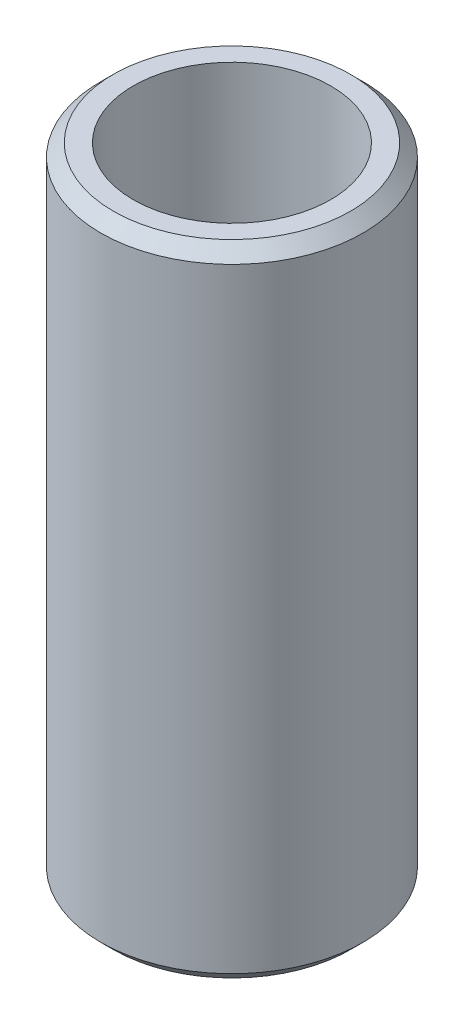
ISO-10303-21;
HEADER;
FILE_DESCRIPTION(('STEP AP214'),'2;1');
FILE_NAME('part.step','',(''),(''),'','','');
FILE_SCHEMA(('AUTOMOTIVE_DESIGN { 1 0 10303 214 1 1 1 1 }'));
ENDSEC;
DATA;
#1=APPLICATION_CONTEXT('core data for automotive mechanical design processes');
#2=APPLICATION_PROTOCOL_DEFINITION('international standard','automotive_design',2000,#1);
#3=PRODUCT_CONTEXT('',#1,'mechanical');
#4=PRODUCT('Part','Part','',(#3));
#5=PRODUCT_RELATED_PRODUCT_CATEGORY('part','',(#4));
#6=PRODUCT_DEFINITION_FORMATION('','',#4);
#7=PRODUCT_DEFINITION_CONTEXT('part definition',#1,'design');
#8=PRODUCT_DEFINITION('design','',#6,#7);
#9=PRODUCT_DEFINITION_SHAPE('','',#8);
#10=(LENGTH_UNIT() NAMED_UNIT(*) SI_UNIT(.MILLI.,.METRE.));
#11=(NAMED_UNIT(*) PLANE_ANGLE_UNIT() SI_UNIT($,.RADIAN.));
#12=(NAMED_UNIT(*) SI_UNIT($,.STERADIAN.) SOLID_ANGLE_UNIT());
#13=UNCERTAINTY_MEASURE_WITH_UNIT(LENGTH_MEASURE(1.E-05),#10,'distance_accuracy_value','');
#14=(GEOMETRIC_REPRESENTATION_CONTEXT(3) GLOBAL_UNCERTAINTY_ASSIGNED_CONTEXT((#13)) GLOBAL_UNIT_ASSIGNED_CONTEXT((#10,
#11,#12)) REPRESENTATION_CONTEXT('',''));
#15=CARTESIAN_POINT('',(0.,0.,0.));
#16=DIRECTION('',(0.,0.,1.));
#17=DIRECTION('',(1.,0.,0.));
#18=AXIS2_PLACEMENT_3D('',#15,#16,#17);
#19=CARTESIAN_POINT('',(0.,280.298555757313,0.));
#20=DIRECTION('',(0.,-1.,0.));
#21=DIRECTION('',(0.,0.,-1.));
#22=AXIS2_PLACEMENT_3D('',#19,#20,#21);
#23=CYLINDRICAL_SURFACE('',#22,57.5);
#24=CARTESIAN_POINT('',(0.,274.777303484476,0.));
#25=DIRECTION('',(0.,1.,0.));
#26=DIRECTION('',(0.,0.,1.));
#27=AXIS2_PLACEMENT_3D('',#24,#25,#26);
#28=CIRCLE('',#27,57.5);
#29=CARTESIAN_POINT('',(0.,274.777303484476,57.5));
#30=VERTEX_POINT('',#29);
#31=EDGE_CURVE('E50',#30,#30,#28,.F.);
#32=ORIENTED_EDGE('',*,*,#31,.T.);
#33=EDGE_LOOP('',(#32));
#34=FACE_BOUND('',#33,.T.);
#35=CARTESIAN_POINT('',(0.,5.52125227283723,0.));
#36=DIRECTION('',(0.,1.,0.));
#37=DIRECTION('',(0.,0.,1.));
#38=AXIS2_PLACEMENT_3D('',#35,#36,#37);
#39=CIRCLE('',#38,57.5);
#40=CARTESIAN_POINT('',(0.,5.52125227283723,57.5));
#41=VERTEX_POINT('',#40);
#42=EDGE_CURVE('E51',#41,#41,#39,.T.);
#43=ORIENTED_EDGE('',*,*,#42,.T.);
#44=EDGE_LOOP('',(#43));
#45=FACE_BOUND('',#44,.T.);
#46=ADVANCED_FACE('F39',(#34,#45),#23,.T.);
#47=CARTESIAN_POINT('',(0.,280.298555757313,0.));
#48=DIRECTION('',(0.,1.,0.));
#49=DIRECTION('',(0.,0.,1.));
#50=AXIS2_PLACEMENT_3D('',#47,#48,#49);
#51=PLANE('',#50);
#52=CARTESIAN_POINT('',(0.,280.298555757313,0.));
#53=DIRECTION('',(0.,1.,0.));
#54=DIRECTION('',(0.,0.,1.));
#55=AXIS2_PLACEMENT_3D('',#52,#53,#54);
#56=CIRCLE('',#55,51.9787477271627);
#57=CARTESIAN_POINT('',(0.,280.298555757313,51.9787477271627));
#58=VERTEX_POINT('',#57);
#59=EDGE_CURVE('E54',#58,#58,#56,.T.);
#60=ORIENTED_EDGE('',*,*,#59,.T.);
#61=EDGE_LOOP('',(#60));
#62=FACE_BOUND('',#61,.T.);
#63=CARTESIAN_POINT('',(0.,280.298555757313,0.));
#64=DIRECTION('',(0.,1.,0.));
#65=DIRECTION('',(0.,0.,1.));
#66=AXIS2_PLACEMENT_3D('',#63,#64,#65);
#67=CIRCLE('',#66,43.2547459969688);
#68=CARTESIAN_POINT('',(0.,280.298555757313,43.2547459969688));
#69=VERTEX_POINT('',#68);
#70=EDGE_CURVE('E58',#69,#69,#67,.T.);
#71=ORIENTED_EDGE('',*,*,#70,.F.);
#72=EDGE_LOOP('',(#71));
#73=FACE_BOUND('',#72,.T.);
#74=ADVANCED_FACE('F69',(#62,#73),#51,.T.);
#75=CARTESIAN_POINT('',(0.,0.,0.));
#76=DIRECTION('',(0.,1.,0.));
#77=DIRECTION('',(0.,0.,1.));
#78=AXIS2_PLACEMENT_3D('',#75,#76,#77);
#79=PLANE('',#78);
#80=CARTESIAN_POINT('',(0.,0.,0.));
#81=DIRECTION('',(0.,1.,0.));
#82=DIRECTION('',(0.,0.,1.));
#83=AXIS2_PLACEMENT_3D('',#80,#81,#82);
#84=CIRCLE('',#83,51.9787477271627);
#85=CARTESIAN_POINT('',(0.,0.,51.9787477271627));
#86=VERTEX_POINT('',#85);
#87=EDGE_CURVE('E10',#86,#86,#84,.F.);
#88=ORIENTED_EDGE('',*,*,#87,.T.);
#89=EDGE_LOOP('',(#88));
#90=FACE_BOUND('',#89,.T.);
#91=CARTESIAN_POINT('',(0.,0.,0.));
#92=DIRECTION('',(0.,1.,0.));
#93=DIRECTION('',(0.,0.,1.));
#94=AXIS2_PLACEMENT_3D('',#91,#92,#93);
#95=CIRCLE('',#94,43.2547459969688);
#96=CARTESIAN_POINT('',(0.,0.,43.2547459969688));
#97=VERTEX_POINT('',#96);
#98=EDGE_CURVE('E63',#97,#97,#95,.T.);
#99=ORIENTED_EDGE('',*,*,#98,.T.);
#100=EDGE_LOOP('',(#99));
#101=FACE_BOUND('',#100,.T.);
#102=ADVANCED_FACE('F75',(#90,#101),#79,.F.);
#103=CARTESIAN_POINT('',(0.,280.298555757313,0.));
#104=DIRECTION('',(0.,-1.,0.));
#105=DIRECTION('',(0.,0.,-1.));
#106=AXIS2_PLACEMENT_3D('',#103,#104,#105);
#107=CYLINDRICAL_SURFACE('',#106,43.2547459969688);
#108=ORIENTED_EDGE('',*,*,#70,.T.);
#109=EDGE_LOOP('',(#108));
#110=FACE_BOUND('',#109,.T.);
#111=ORIENTED_EDGE('',*,*,#98,.F.);
#112=EDGE_LOOP('',(#111));
#113=FACE_BOUND('',#112,.T.);
#114=ADVANCED_FACE('F70',(#110,#113),#107,.F.);
#115=CARTESIAN_POINT('',(0.,280.298555757313,0.));
#116=DIRECTION('',(0.,-1.,0.));
#117=DIRECTION('',(0.,0.,-1.));
#118=AXIS2_PLACEMENT_3D('',#115,#116,#117);
#119=CONICAL_SURFACE('',#118,51.9787477271627,0.785398163397446);
#120=ORIENTED_EDGE('',*,*,#31,.F.);
#121=EDGE_LOOP('',(#120));
#122=FACE_BOUND('',#121,.T.);
#123=ORIENTED_EDGE('',*,*,#59,.F.);
#124=EDGE_LOOP('',(#123));
#125=FACE_BOUND('',#124,.T.);
#126=ADVANCED_FACE('F81',(#122,#125),#119,.T.);
#127=CARTESIAN_POINT('',(0.,5.52125227283723,0.));
#128=DIRECTION('',(0.,1.,0.));
#129=DIRECTION('',(0.,0.,1.));
#130=AXIS2_PLACEMENT_3D('',#127,#128,#129);
#131=CONICAL_SURFACE('',#130,57.5,0.785398163397451);
#132=CARTESIAN_POINT('',(0.,0.,51.9787477271627));
#133=CARTESIAN_POINT('',(0.,0.057513044508722,52.0362607716715));
#134=CARTESIAN_POINT('',(0.,0.115026089017443,52.0937738161802));
#135=CARTESIAN_POINT('',(0.,0.230052178034884,52.2087999051976));
#136=CARTESIAN_POINT('',(0.,0.287565222543604,52.2663129497064));
#137=CARTESIAN_POINT('',(0.,0.402591311561046,52.3813390387238));
#138=CARTESIAN_POINT('',(0.,0.460104356069768,52.4388520832325));
#139=CARTESIAN_POINT('',(0.,0.575130445087211,52.55387817225));
#140=CARTESIAN_POINT('',(0.,0.632643489595932,52.6113912167587));
#141=CARTESIAN_POINT('',(0.,0.747669578613374,52.7264173057761));
#142=CARTESIAN_POINT('',(0.,0.805182623122095,52.7839303502848));
#143=CARTESIAN_POINT('',(0.,0.920208712139537,52.8989564393023));
#144=CARTESIAN_POINT('',(0.,0.977721756648258,52.956469483811));
#145=CARTESIAN_POINT('',(0.,1.0927478456657,53.0714955728284));
#146=CARTESIAN_POINT('',(0.,1.15026089017442,53.1290086173372));
#147=CARTESIAN_POINT('',(0.,1.26528697919186,53.2440347063546));
#148=CARTESIAN_POINT('',(0.,1.32280002370059,53.3015477508633));
#149=CARTESIAN_POINT('',(0.,1.43782611271803,53.4165738398808));
#150=CARTESIAN_POINT('',(0.,1.49533915722675,53.4740868843895));
#151=CARTESIAN_POINT('',(0.,1.61036524624419,53.5891129734069));
#152=CARTESIAN_POINT('',(0.,1.66787829075291,53.6466260179157));
#153=CARTESIAN_POINT('',(0.,1.78290437977035,53.7616521069331));
#154=CARTESIAN_POINT('',(0.,1.84041742427907,53.8191651514418));
#155=CARTESIAN_POINT('',(0.,1.95544351329652,53.9341912404593));
#156=CARTESIAN_POINT('',(0.,2.01295655780524,53.991704284968));
#157=CARTESIAN_POINT('',(0.,2.12798264682268,54.1067303739854));
#158=CARTESIAN_POINT('',(0.,2.1854956913314,54.1642434184942));
#159=CARTESIAN_POINT('',(0.,2.30052178034884,54.2792695075116));
#160=CARTESIAN_POINT('',(0.,2.35803482485757,54.3367825520203));
#161=CARTESIAN_POINT('',(0.,2.47306091387501,54.4518086410378));
#162=CARTESIAN_POINT('',(0.,2.53057395838373,54.5093216855465));
#163=CARTESIAN_POINT('',(0.,2.64560004740117,54.6243477745639));
#164=CARTESIAN_POINT('',(0.,2.70311309190989,54.6818608190726));
#165=CARTESIAN_POINT('',(0.,2.81813918092733,54.7968869080901));
#166=CARTESIAN_POINT('',(0.,2.87565222543606,54.8543999525988));
#167=CARTESIAN_POINT('',(0.,2.9906783144535,54.9694260416163));
#168=CARTESIAN_POINT('',(0.,3.04819135896222,55.026939086125));
#169=CARTESIAN_POINT('',(0.,3.16321744797966,55.1419651751424));
#170=CARTESIAN_POINT('',(0.,3.22073049248838,55.1994782196511));
#171=CARTESIAN_POINT('',(0.,3.33575658150583,55.3145043086686));
#172=CARTESIAN_POINT('',(0.,3.39326962601455,55.3720173531773));
#173=CARTESIAN_POINT('',(0.,3.50829571503199,55.4870434421948));
#174=CARTESIAN_POINT('',(0.,3.56580875954071,55.5445564867035));
#175=CARTESIAN_POINT('',(0.,3.68083484855815,55.6595825757209));
#176=CARTESIAN_POINT('',(0.,3.73834789306687,55.7170956202296));
#177=CARTESIAN_POINT('',(0.,3.85337398208432,55.8321217092471));
#178=CARTESIAN_POINT('',(0.,3.91088702659304,55.8896347537558));
#179=CARTESIAN_POINT('',(0.,4.02591311561048,56.0046608427732));
#180=CARTESIAN_POINT('',(0.,4.0834261601192,56.062173887282));
#181=CARTESIAN_POINT('',(0.,4.19845224913664,56.1771999762994));
#182=CARTESIAN_POINT('',(0.,4.25596529364536,56.2347130208081));
#183=CARTESIAN_POINT('',(0.,4.37099138266281,56.3497391098256));
#184=CARTESIAN_POINT('',(0.,4.42850442717153,56.4072521543343));
#185=CARTESIAN_POINT('',(0.,4.54353051618897,56.5222782433517));
#186=CARTESIAN_POINT('',(0.,4.60104356069769,56.5797912878605));
#187=CARTESIAN_POINT('',(0.,4.71606964971513,56.6948173768779));
#188=CARTESIAN_POINT('',(0.,4.77358269422385,56.7523304213866));
#189=CARTESIAN_POINT('',(0.,4.8886087832413,56.8673565104041));
#190=CARTESIAN_POINT('',(0.,4.94612182775002,56.9248695549128));
#191=CARTESIAN_POINT('',(0.,5.06114791676746,57.0398956439302));
#192=CARTESIAN_POINT('',(0.,5.11866096127618,57.097408688439));
#193=CARTESIAN_POINT('',(0.,5.23368705029362,57.2124347774564));
#194=CARTESIAN_POINT('',(0.,5.29120009480234,57.2699478219651));
#195=CARTESIAN_POINT('',(0.,5.40622618381979,57.3849739109826));
#196=CARTESIAN_POINT('',(0.,5.46373922832851,57.4424869554913));
#197=CARTESIAN_POINT('',(0.,5.52125227283723,57.5));
#198=B_SPLINE_CURVE_WITH_KNOTS('',3,(#132,#133,#134,#135,#136,#137,#138,#139,#140,#141,#142,
#143,#144,#145,#146,#147,#148,#149,#150,#151,#152,#153,#154,#155,#156,#157,#158,#159,#160,#161,
#162,#163,#164,#165,#166,#167,#168,#169,#170,#171,#172,#173,#174,#175,#176,#177,#178,#179,#180,
#181,#182,#183,#184,#185,#186,#187,#188,#189,#190,#191,#192,#193,#194,#195,#196,#197),
.UNSPECIFIED.,.F.,.F.,(4,2,2,2,2,2,2,2,2,2,2,2,2,2,2,2,2,2,2,2,2,2,2,2,2,2,2,2,2,2,2,2,4),(0.,
0.244007182672801,0.488014365345608,0.732021548018409,0.976028730691211,1.22003591336402,
1.46404309603682,1.70805027870962,1.95205746138243,2.19606464405523,2.44007182672803,
2.68407900940083,2.92808619207364,3.17209337474644,3.41610055741924,3.66010774009205,
3.90411492276485,4.14812210543765,4.39212928811046,4.63613647078326,4.88014365345606,
5.12415083612887,5.36815801880167,5.61216520147447,5.85617238414728,6.10017956682008,
6.34418674949289,6.58819393216569,6.83220111483849,7.0762082975113,7.3202154801841,
7.5642226628569,7.80822984552971),.UNSPECIFIED.);
#199=EDGE_CURVE('BSEAM45',#86,#41,#198,.T.);
#200=ORIENTED_EDGE('',*,*,#87,.F.);
#201=ORIENTED_EDGE('',*,*,#42,.F.);
#202=ORIENTED_EDGE('',*,*,#199,.T.);
#203=ORIENTED_EDGE('',*,*,#199,.F.);
#204=EDGE_LOOP('',(#200,#202,#201,#203));
#205=FACE_BOUND('',#204,.T.);
#206=ADVANCED_FACE('F45',(#205),#131,.T.);
#207=CLOSED_SHELL('',(#46,#74,#102,#114,#126,#206));
#208=MANIFOLD_SOLID_BREP('B2',#207);
#209=ADVANCED_BREP_SHAPE_REPRESENTATION('',(#18,#208),#14);
#210=SHAPE_DEFINITION_REPRESENTATION(#9,#209);
ENDSEC;
END-ISO-10303-21;
